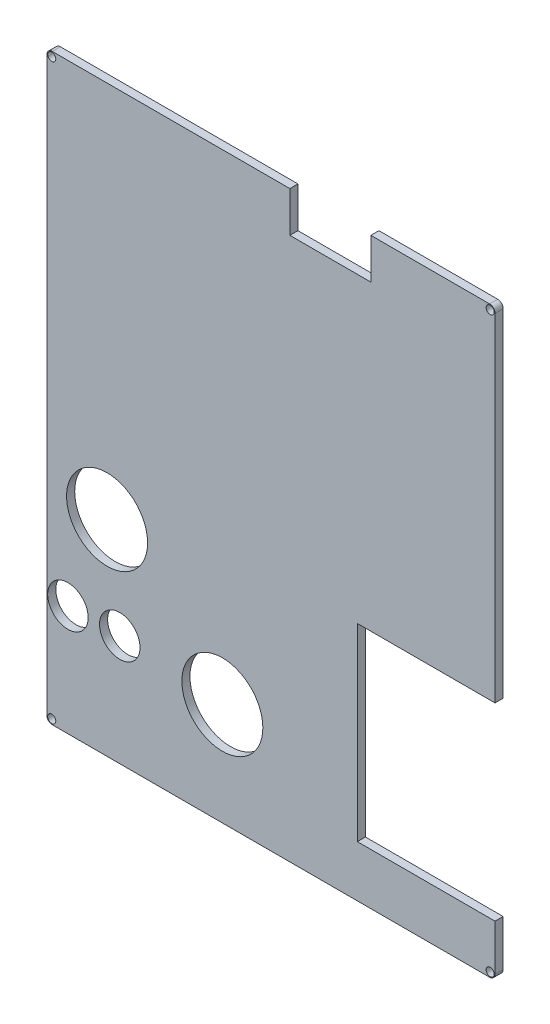
ISO-10303-21;
HEADER;
FILE_DESCRIPTION(('STEP AP214'),'2;1');
FILE_NAME('part.step','',(''),(''),'','','');
FILE_SCHEMA(('AUTOMOTIVE_DESIGN { 1 0 10303 214 1 1 1 1 }'));
ENDSEC;
DATA;
#1=APPLICATION_CONTEXT('core data for automotive mechanical design processes');
#2=APPLICATION_PROTOCOL_DEFINITION('international standard','automotive_design',2000,#1);
#3=PRODUCT_CONTEXT('',#1,'mechanical');
#4=PRODUCT('Part','Part','',(#3));
#5=PRODUCT_RELATED_PRODUCT_CATEGORY('part','',(#4));
#6=PRODUCT_DEFINITION_FORMATION('','',#4);
#7=PRODUCT_DEFINITION_CONTEXT('part definition',#1,'design');
#8=PRODUCT_DEFINITION('design','',#6,#7);
#9=PRODUCT_DEFINITION_SHAPE('','',#8);
#10=(LENGTH_UNIT() NAMED_UNIT(*) SI_UNIT(.MILLI.,.METRE.));
#11=(NAMED_UNIT(*) PLANE_ANGLE_UNIT() SI_UNIT($,.RADIAN.));
#12=(NAMED_UNIT(*) SI_UNIT($,.STERADIAN.) SOLID_ANGLE_UNIT());
#13=UNCERTAINTY_MEASURE_WITH_UNIT(LENGTH_MEASURE(1.E-05),#10,'distance_accuracy_value','');
#14=(GEOMETRIC_REPRESENTATION_CONTEXT(3) GLOBAL_UNCERTAINTY_ASSIGNED_CONTEXT((#13)) GLOBAL_UNIT_ASSIGNED_CONTEXT((#10,
#11,#12)) REPRESENTATION_CONTEXT('',''));
#15=CARTESIAN_POINT('',(0.,0.,0.));
#16=DIRECTION('',(0.,0.,1.));
#17=DIRECTION('',(1.,0.,0.));
#18=AXIS2_PLACEMENT_3D('',#15,#16,#17);
#19=CARTESIAN_POINT('',(-0.269341232726582,0.,0.));
#20=DIRECTION('',(1.,0.,0.));
#21=DIRECTION('',(0.,1.,0.));
#22=AXIS2_PLACEMENT_3D('',#19,#20,#21);
#23=PLANE('',#22);
#24=DIRECTION('',(0.,1.,0.));
#25=VECTOR('',#24,1.);
#26=CARTESIAN_POINT('',(-0.269341232726599,130.41095890411,0.));
#27=LINE('',#26,#25);
#28=CARTESIAN_POINT('',(-0.269341232726582,3.41095890410956,0.));
#29=VERTEX_POINT('',#28);
#30=CARTESIAN_POINT('',(-0.269341232726599,128.41095890411,0.));
#31=VERTEX_POINT('',#30);
#32=EDGE_CURVE('E166',#29,#31,#27,.T.);
#33=ORIENTED_EDGE('',*,*,#32,.T.);
#34=DIRECTION('',(0.,0.,1.));
#35=VECTOR('',#34,1.);
#36=CARTESIAN_POINT('',(-0.269341232726599,128.41095890411,0.));
#37=LINE('',#36,#35);
#38=CARTESIAN_POINT('',(-0.269341232726599,128.41095890411,3.));
#39=VERTEX_POINT('',#38);
#40=EDGE_CURVE('E340',#31,#39,#37,.T.);
#41=ORIENTED_EDGE('',*,*,#40,.T.);
#42=DIRECTION('',(0.,-1.,0.));
#43=VECTOR('',#42,1.);
#44=CARTESIAN_POINT('',(-0.269341232726599,130.41095890411,3.));
#45=LINE('',#44,#43);
#46=CARTESIAN_POINT('',(-0.269341232726583,3.41095890410956,3.));
#47=VERTEX_POINT('',#46);
#48=EDGE_CURVE('E203',#39,#47,#45,.T.);
#49=ORIENTED_EDGE('',*,*,#48,.T.);
#50=DIRECTION('',(0.,0.,1.));
#51=VECTOR('',#50,1.);
#52=CARTESIAN_POINT('',(-0.269341232726583,3.41095890410956,3.));
#53=LINE('',#52,#51);
#54=EDGE_CURVE('E183',#29,#47,#53,.T.);
#55=ORIENTED_EDGE('',*,*,#54,.F.);
#56=EDGE_LOOP('',(#33,#41,#49,#55));
#57=FACE_BOUND('',#56,.T.);
#58=ADVANCED_FACE('F39',(#57),#23,.T.);
#59=CARTESIAN_POINT('',(-166.269341232727,130.41095890411,3.));
#60=DIRECTION('',(0.,1.,0.));
#61=DIRECTION('',(-1.,0.,0.));
#62=AXIS2_PLACEMENT_3D('',#59,#60,#61);
#63=PLANE('',#62);
#64=DIRECTION('',(0.,0.,1.));
#65=VECTOR('',#64,1.);
#66=CARTESIAN_POINT('',(-76.2693412327266,130.41095890411,-853.));
#67=LINE('',#66,#65);
#68=CARTESIAN_POINT('',(-76.2693412327266,130.41095890411,-2.22044604925031E-13));
#69=VERTEX_POINT('',#68);
#70=CARTESIAN_POINT('',(-76.2693412327266,130.41095890411,3.));
#71=VERTEX_POINT('',#70);
#72=EDGE_CURVE('E217',#69,#71,#67,.T.);
#73=ORIENTED_EDGE('',*,*,#72,.F.);
#74=DIRECTION('',(1.,0.,0.));
#75=VECTOR('',#74,1.);
#76=CARTESIAN_POINT('',(-166.269341232727,130.41095890411,0.));
#77=LINE('',#76,#75);
#78=CARTESIAN_POINT('',(-164.269341232727,130.41095890411,0.));
#79=VERTEX_POINT('',#78);
#80=EDGE_CURVE('E279',#79,#69,#77,.T.);
#81=ORIENTED_EDGE('',*,*,#80,.F.);
#82=DIRECTION('',(0.,0.,-1.));
#83=VECTOR('',#82,1.);
#84=CARTESIAN_POINT('',(-164.269341232727,130.41095890411,3.));
#85=LINE('',#84,#83);
#86=CARTESIAN_POINT('',(-164.269341232727,130.41095890411,3.));
#87=VERTEX_POINT('',#86);
#88=EDGE_CURVE('E293',#79,#87,#85,.F.);
#89=ORIENTED_EDGE('',*,*,#88,.T.);
#90=DIRECTION('',(1.,0.,0.));
#91=VECTOR('',#90,1.);
#92=CARTESIAN_POINT('',(-166.269341232727,130.41095890411,3.));
#93=LINE('',#92,#91);
#94=EDGE_CURVE('E270',#87,#71,#93,.T.);
#95=ORIENTED_EDGE('',*,*,#94,.T.);
#96=EDGE_LOOP('',(#73,#81,#89,#95));
#97=FACE_BOUND('',#96,.T.);
#98=ADVANCED_FACE('F388',(#97),#63,.T.);
#99=CARTESIAN_POINT('',(-46.2693412327266,130.41095890411,3.));
#100=VERTEX_POINT('',#99);
#101=CARTESIAN_POINT('',(-2.2693412327266,130.41095890411,3.));
#102=VERTEX_POINT('',#101);
#103=EDGE_CURVE('E275',#100,#102,#93,.T.);
#104=ORIENTED_EDGE('',*,*,#103,.T.);
#105=DIRECTION('',(0.,0.,1.));
#106=VECTOR('',#105,1.);
#107=CARTESIAN_POINT('',(-2.2693412327266,130.41095890411,3.));
#108=LINE('',#107,#106);
#109=CARTESIAN_POINT('',(-2.2693412327266,130.41095890411,0.));
#110=VERTEX_POINT('',#109);
#111=EDGE_CURVE('E347',#102,#110,#108,.F.);
#112=ORIENTED_EDGE('',*,*,#111,.T.);
#113=CARTESIAN_POINT('',(-46.2693412327266,130.41095890411,-2.22044604925031E-13));
#114=VERTEX_POINT('',#113);
#115=EDGE_CURVE('E284',#114,#110,#77,.T.);
#116=ORIENTED_EDGE('',*,*,#115,.F.);
#117=DIRECTION('',(0.,0.,1.));
#118=VECTOR('',#117,1.);
#119=CARTESIAN_POINT('',(-46.2693412327266,130.41095890411,-853.));
#120=LINE('',#119,#118);
#121=EDGE_CURVE('E221',#114,#100,#120,.T.);
#122=ORIENTED_EDGE('',*,*,#121,.T.);
#123=EDGE_LOOP('',(#104,#112,#116,#122));
#124=FACE_BOUND('',#123,.T.);
#125=ADVANCED_FACE('F404',(#124),#63,.T.);
#126=CARTESIAN_POINT('',(-166.269341232727,130.41095890411,3.));
#127=DIRECTION('',(1.,0.,0.));
#128=DIRECTION('',(0.,0.,-1.));
#129=AXIS2_PLACEMENT_3D('',#126,#127,#128);
#130=PLANE('',#129);
#131=DIRECTION('',(0.,-1.,0.));
#132=VECTOR('',#131,1.);
#133=CARTESIAN_POINT('',(-166.269341232727,130.41095890411,0.));
#134=LINE('',#133,#132);
#135=CARTESIAN_POINT('',(-166.269341232727,128.41095890411,0.));
#136=VERTEX_POINT('',#135);
#137=CARTESIAN_POINT('',(-166.269341232727,-83.5890410958905,0.));
#138=VERTEX_POINT('',#137);
#139=EDGE_CURVE('E283',#136,#138,#134,.T.);
#140=ORIENTED_EDGE('',*,*,#139,.T.);
#141=DIRECTION('',(0.,0.,-1.));
#142=VECTOR('',#141,1.);
#143=CARTESIAN_POINT('',(-166.269341232727,-83.5890410958905,3.));
#144=LINE('',#143,#142);
#145=CARTESIAN_POINT('',(-166.269341232727,-83.5890410958905,3.));
#146=VERTEX_POINT('',#145);
#147=EDGE_CURVE('E48',#138,#146,#144,.F.);
#148=ORIENTED_EDGE('',*,*,#147,.T.);
#149=DIRECTION('',(0.,-1.,0.));
#150=VECTOR('',#149,1.);
#151=CARTESIAN_POINT('',(-166.269341232727,130.41095890411,3.));
#152=LINE('',#151,#150);
#153=CARTESIAN_POINT('',(-166.269341232727,128.41095890411,3.));
#154=VERTEX_POINT('',#153);
#155=EDGE_CURVE('E274',#154,#146,#152,.T.);
#156=ORIENTED_EDGE('',*,*,#155,.F.);
#157=DIRECTION('',(0.,0.,-1.));
#158=VECTOR('',#157,1.);
#159=CARTESIAN_POINT('',(-166.269341232727,128.41095890411,0.));
#160=LINE('',#159,#158);
#161=EDGE_CURVE('E278',#154,#136,#160,.T.);
#162=ORIENTED_EDGE('',*,*,#161,.T.);
#163=EDGE_LOOP('',(#140,#148,#156,#162));
#164=FACE_BOUND('',#163,.T.);
#165=ADVANCED_FACE('F380',(#164),#130,.F.);
#166=CARTESIAN_POINT('',(0.,0.,3.));
#167=DIRECTION('',(0.,0.,-1.));
#168=DIRECTION('',(-1.,0.,0.));
#169=AXIS2_PLACEMENT_3D('',#166,#167,#168);
#170=PLANE('',#169);
#171=CARTESIAN_POINT('',(-164.469341232727,-83.7890410958904,3.));
#172=DIRECTION('',(0.,0.,1.));
#173=DIRECTION('',(1.,0.,0.));
#174=AXIS2_PLACEMENT_3D('',#171,#172,#173);
#175=CIRCLE('',#174,1.5);
#176=CARTESIAN_POINT('',(-162.969341232727,-83.7890410958904,3.));
#177=VERTEX_POINT('',#176);
#178=EDGE_CURVE('E720',#177,#177,#175,.T.);
#179=ORIENTED_EDGE('',*,*,#178,.F.);
#180=EDGE_LOOP('',(#179));
#181=FACE_BOUND('',#180,.T.);
#182=CARTESIAN_POINT('',(-2.06934123272657,-83.7890410958905,3.));
#183=DIRECTION('',(0.,0.,1.));
#184=DIRECTION('',(1.,0.,0.));
#185=AXIS2_PLACEMENT_3D('',#182,#183,#184);
#186=CIRCLE('',#185,1.5);
#187=CARTESIAN_POINT('',(-0.569341232726571,-83.7890410958905,3.));
#188=VERTEX_POINT('',#187);
#189=EDGE_CURVE('E711',#188,#188,#186,.T.);
#190=ORIENTED_EDGE('',*,*,#189,.F.);
#191=EDGE_LOOP('',(#190));
#192=FACE_BOUND('',#191,.T.);
#193=CARTESIAN_POINT('',(-2.0693412327266,128.61095890411,3.));
#194=DIRECTION('',(0.,0.,1.));
#195=DIRECTION('',(1.,0.,0.));
#196=AXIS2_PLACEMENT_3D('',#193,#194,#195);
#197=CIRCLE('',#196,1.5);
#198=CARTESIAN_POINT('',(-0.569341232726598,128.61095890411,3.));
#199=VERTEX_POINT('',#198);
#200=EDGE_CURVE('E192',#199,#199,#197,.T.);
#201=ORIENTED_EDGE('',*,*,#200,.F.);
#202=EDGE_LOOP('',(#201));
#203=FACE_BOUND('',#202,.T.);
#204=CARTESIAN_POINT('',(-158.469341232727,-44.5890410958904,3.));
#205=DIRECTION('',(0.,0.,1.));
#206=DIRECTION('',(1.,0.,0.));
#207=AXIS2_PLACEMENT_3D('',#204,#205,#206);
#208=CIRCLE('',#207,7.50000000000001);
#209=CARTESIAN_POINT('',(-150.969341232727,-44.5890410958904,3.));
#210=VERTEX_POINT('',#209);
#211=EDGE_CURVE('E220',#210,#210,#208,.T.);
#212=ORIENTED_EDGE('',*,*,#211,.F.);
#213=EDGE_LOOP('',(#212));
#214=FACE_BOUND('',#213,.T.);
#215=CARTESIAN_POINT('',(-139.269341232727,-44.5890410958904,3.));
#216=DIRECTION('',(0.,0.,1.));
#217=DIRECTION('',(1.,0.,0.));
#218=AXIS2_PLACEMENT_3D('',#215,#216,#217);
#219=CIRCLE('',#218,7.50000000000001);
#220=CARTESIAN_POINT('',(-131.769341232727,-44.5890410958904,3.));
#221=VERTEX_POINT('',#220);
#222=EDGE_CURVE('E234',#221,#221,#219,.T.);
#223=ORIENTED_EDGE('',*,*,#222,.F.);
#224=EDGE_LOOP('',(#223));
#225=FACE_BOUND('',#224,.T.);
#226=CARTESIAN_POINT('',(-143.966076440975,-9.58904109589044,3.));
#227=DIRECTION('',(0.,0.,1.));
#228=DIRECTION('',(1.,0.,0.));
#229=AXIS2_PLACEMENT_3D('',#226,#227,#228);
#230=CIRCLE('',#229,15.);
#231=CARTESIAN_POINT('',(-128.966076440975,-9.58904109589044,3.));
#232=VERTEX_POINT('',#231);
#233=EDGE_CURVE('E239',#232,#232,#230,.T.);
#234=ORIENTED_EDGE('',*,*,#233,.F.);
#235=EDGE_LOOP('',(#234));
#236=FACE_BOUND('',#235,.T.);
#237=CARTESIAN_POINT('',(-101.269341232727,-47.5890410958904,3.));
#238=DIRECTION('',(0.,0.,1.));
#239=DIRECTION('',(1.,0.,0.));
#240=AXIS2_PLACEMENT_3D('',#237,#238,#239);
#241=CIRCLE('',#240,15.);
#242=CARTESIAN_POINT('',(-86.2693412327266,-47.5890410958904,3.));
#243=VERTEX_POINT('',#242);
#244=EDGE_CURVE('E244',#243,#243,#241,.T.);
#245=ORIENTED_EDGE('',*,*,#244,.F.);
#246=EDGE_LOOP('',(#245));
#247=FACE_BOUND('',#246,.T.);
#248=CARTESIAN_POINT('',(-164.469341232727,128.61095890411,3.));
#249=DIRECTION('',(0.,0.,1.));
#250=DIRECTION('',(1.,0.,0.));
#251=AXIS2_PLACEMENT_3D('',#248,#249,#250);
#252=CIRCLE('',#251,1.5);
#253=CARTESIAN_POINT('',(-162.969341232727,128.61095890411,3.));
#254=VERTEX_POINT('',#253);
#255=EDGE_CURVE('E263',#254,#254,#252,.T.);
#256=ORIENTED_EDGE('',*,*,#255,.F.);
#257=EDGE_LOOP('',(#256));
#258=FACE_BOUND('',#257,.T.);
#259=ORIENTED_EDGE('',*,*,#155,.T.);
#260=CARTESIAN_POINT('',(-164.269341232727,-83.5890410958905,3.));
#261=DIRECTION('',(0.,0.,-1.));
#262=DIRECTION('',(-1.,0.,0.));
#263=AXIS2_PLACEMENT_3D('',#260,#261,#262);
#264=CIRCLE('',#263,2.);
#265=CARTESIAN_POINT('',(-164.269341232727,-85.5890410958905,3.));
#266=VERTEX_POINT('',#265);
#267=EDGE_CURVE('E11',#146,#266,#264,.F.);
#268=ORIENTED_EDGE('',*,*,#267,.T.);
#269=DIRECTION('',(-1.,0.,0.));
#270=VECTOR('',#269,1.);
#271=CARTESIAN_POINT('',(-166.269341232727,-85.5890410958905,3.));
#272=LINE('',#271,#270);
#273=CARTESIAN_POINT('',(-2.26934123272662,-85.5890410958905,3.));
#274=VERTEX_POINT('',#273);
#275=EDGE_CURVE('E198',#274,#266,#272,.T.);
#276=ORIENTED_EDGE('',*,*,#275,.F.);
#277=CARTESIAN_POINT('',(-2.26934123272657,-83.5890410958905,3.));
#278=DIRECTION('',(0.,0.,-1.));
#279=DIRECTION('',(-1.,0.,0.));
#280=AXIS2_PLACEMENT_3D('',#277,#278,#279);
#281=CIRCLE('',#280,2.);
#282=CARTESIAN_POINT('',(-0.269341232726571,-83.5890410958904,3.));
#283=VERTEX_POINT('',#282);
#284=EDGE_CURVE('E332',#274,#283,#281,.F.);
#285=ORIENTED_EDGE('',*,*,#284,.T.);
#286=CARTESIAN_POINT('',(-0.269341232726573,-66.5890410958905,3.));
#287=VERTEX_POINT('',#286);
#288=EDGE_CURVE('E202',#287,#283,#45,.T.);
#289=ORIENTED_EDGE('',*,*,#288,.F.);
#290=DIRECTION('',(1.,0.,0.));
#291=VECTOR('',#290,1.);
#292=CARTESIAN_POINT('',(-51.2693412327266,-66.5890410958905,3.));
#293=LINE('',#292,#291);
#294=CARTESIAN_POINT('',(-51.2693412327266,-66.5890410958905,3.));
#295=VERTEX_POINT('',#294);
#296=EDGE_CURVE('E181',#295,#287,#293,.T.);
#297=ORIENTED_EDGE('',*,*,#296,.F.);
#298=DIRECTION('',(0.,-1.,0.));
#299=VECTOR('',#298,1.);
#300=CARTESIAN_POINT('',(-51.2693412327266,3.41095890410956,3.));
#301=LINE('',#300,#299);
#302=CARTESIAN_POINT('',(-51.2693412327266,3.41095890410956,3.));
#303=VERTEX_POINT('',#302);
#304=EDGE_CURVE('E255',#303,#295,#301,.T.);
#305=ORIENTED_EDGE('',*,*,#304,.F.);
#306=DIRECTION('',(1.,0.,0.));
#307=VECTOR('',#306,1.);
#308=CARTESIAN_POINT('',(-51.2693412327266,3.41095890410956,3.));
#309=LINE('',#308,#307);
#310=EDGE_CURVE('E251',#303,#47,#309,.T.);
#311=ORIENTED_EDGE('',*,*,#310,.T.);
#312=ORIENTED_EDGE('',*,*,#48,.F.);
#313=CARTESIAN_POINT('',(-2.2693412327266,128.41095890411,3.));
#314=DIRECTION('',(0.,0.,-1.));
#315=DIRECTION('',(-1.,0.,0.));
#316=AXIS2_PLACEMENT_3D('',#313,#314,#315);
#317=CIRCLE('',#316,2.);
#318=EDGE_CURVE('E344',#39,#102,#317,.F.);
#319=ORIENTED_EDGE('',*,*,#318,.T.);
#320=ORIENTED_EDGE('',*,*,#103,.F.);
#321=DIRECTION('',(0.,1.,0.));
#322=VECTOR('',#321,1.);
#323=CARTESIAN_POINT('',(-46.2693412327266,115.41095890411,3.));
#324=LINE('',#323,#322);
#325=CARTESIAN_POINT('',(-46.2693412327266,115.41095890411,3.));
#326=VERTEX_POINT('',#325);
#327=EDGE_CURVE('E213',#326,#100,#324,.T.);
#328=ORIENTED_EDGE('',*,*,#327,.F.);
#329=DIRECTION('',(1.,0.,0.));
#330=VECTOR('',#329,1.);
#331=CARTESIAN_POINT('',(-76.2693412327266,115.41095890411,3.));
#332=LINE('',#331,#330);
#333=CARTESIAN_POINT('',(-76.2693412327266,115.41095890411,3.));
#334=VERTEX_POINT('',#333);
#335=EDGE_CURVE('E209',#334,#326,#332,.T.);
#336=ORIENTED_EDGE('',*,*,#335,.F.);
#337=DIRECTION('',(0.,-1.,0.));
#338=VECTOR('',#337,1.);
#339=CARTESIAN_POINT('',(-76.2693412327266,115.41095890411,3.));
#340=LINE('',#339,#338);
#341=EDGE_CURVE('E165',#71,#334,#340,.T.);
#342=ORIENTED_EDGE('',*,*,#341,.F.);
#343=ORIENTED_EDGE('',*,*,#94,.F.);
#344=CARTESIAN_POINT('',(-164.269341232727,128.41095890411,3.));
#345=DIRECTION('',(0.,0.,-1.));
#346=DIRECTION('',(-1.,0.,0.));
#347=AXIS2_PLACEMENT_3D('',#344,#345,#346);
#348=CIRCLE('',#347,2.);
#349=EDGE_CURVE('E296',#87,#154,#348,.F.);
#350=ORIENTED_EDGE('',*,*,#349,.T.);
#351=EDGE_LOOP('',(#259,#268,#276,#285,#289,#297,#305,#311,#312,#319,#320,#328,#336,#342,#343,#350));
#352=FACE_BOUND('',#351,.T.);
#353=ADVANCED_FACE('F376',(#181,#192,#203,#214,#225,#236,#247,#258,#352),#170,.F.);
#354=CARTESIAN_POINT('',(0.,0.,0.));
#355=DIRECTION('',(0.,0.,-1.));
#356=DIRECTION('',(-1.,0.,0.));
#357=AXIS2_PLACEMENT_3D('',#354,#355,#356);
#358=PLANE('',#357);
#359=CARTESIAN_POINT('',(-164.469341232727,-83.7890410958904,0.));
#360=DIRECTION('',(0.,0.,1.));
#361=DIRECTION('',(1.,0.,0.));
#362=AXIS2_PLACEMENT_3D('',#359,#360,#361);
#363=CIRCLE('',#362,1.5);
#364=CARTESIAN_POINT('',(-162.969341232727,-83.7890410958904,0.));
#365=VERTEX_POINT('',#364);
#366=EDGE_CURVE('E717',#365,#365,#363,.T.);
#367=ORIENTED_EDGE('',*,*,#366,.T.);
#368=EDGE_LOOP('',(#367));
#369=FACE_BOUND('',#368,.T.);
#370=CARTESIAN_POINT('',(-2.06934123272657,-83.7890410958905,0.));
#371=DIRECTION('',(0.,0.,1.));
#372=DIRECTION('',(1.,0.,0.));
#373=AXIS2_PLACEMENT_3D('',#370,#371,#372);
#374=CIRCLE('',#373,1.5);
#375=CARTESIAN_POINT('',(-0.569341232726571,-83.7890410958905,0.));
#376=VERTEX_POINT('',#375);
#377=EDGE_CURVE('E708',#376,#376,#374,.T.);
#378=ORIENTED_EDGE('',*,*,#377,.T.);
#379=EDGE_LOOP('',(#378));
#380=FACE_BOUND('',#379,.T.);
#381=CARTESIAN_POINT('',(-2.0693412327266,128.61095890411,0.));
#382=DIRECTION('',(0.,0.,1.));
#383=DIRECTION('',(1.,0.,0.));
#384=AXIS2_PLACEMENT_3D('',#381,#382,#383);
#385=CIRCLE('',#384,1.5);
#386=CARTESIAN_POINT('',(-0.569341232726598,128.61095890411,0.));
#387=VERTEX_POINT('',#386);
#388=EDGE_CURVE('E184',#387,#387,#385,.T.);
#389=ORIENTED_EDGE('',*,*,#388,.T.);
#390=EDGE_LOOP('',(#389));
#391=FACE_BOUND('',#390,.T.);
#392=DIRECTION('',(1.,0.,0.));
#393=VECTOR('',#392,1.);
#394=CARTESIAN_POINT('',(-166.269341232727,-85.5890410958905,0.));
#395=LINE('',#394,#393);
#396=CARTESIAN_POINT('',(-164.269341232727,-85.5890410958905,0.));
#397=VERTEX_POINT('',#396);
#398=CARTESIAN_POINT('',(-2.26934123272662,-85.5890410958905,0.));
#399=VERTEX_POINT('',#398);
#400=EDGE_CURVE('E189',#397,#399,#395,.T.);
#401=ORIENTED_EDGE('',*,*,#400,.F.);
#402=CARTESIAN_POINT('',(-164.269341232727,-83.5890410958905,0.));
#403=DIRECTION('',(0.,0.,-1.));
#404=DIRECTION('',(-1.,0.,0.));
#405=AXIS2_PLACEMENT_3D('',#402,#403,#404);
#406=CIRCLE('',#405,2.);
#407=EDGE_CURVE('E62',#397,#138,#406,.T.);
#408=ORIENTED_EDGE('',*,*,#407,.T.);
#409=ORIENTED_EDGE('',*,*,#139,.F.);
#410=CARTESIAN_POINT('',(-164.269341232727,128.41095890411,0.));
#411=DIRECTION('',(0.,0.,-1.));
#412=DIRECTION('',(-1.,0.,0.));
#413=AXIS2_PLACEMENT_3D('',#410,#411,#412);
#414=CIRCLE('',#413,2.);
#415=EDGE_CURVE('E290',#136,#79,#414,.T.);
#416=ORIENTED_EDGE('',*,*,#415,.T.);
#417=ORIENTED_EDGE('',*,*,#80,.T.);
#418=DIRECTION('',(0.,1.,0.));
#419=VECTOR('',#418,1.);
#420=CARTESIAN_POINT('',(-76.2693412327266,0.,0.));
#421=LINE('',#420,#419);
#422=CARTESIAN_POINT('',(-76.2693412327266,115.41095890411,-2.22044604925031E-13));
#423=VERTEX_POINT('',#422);
#424=EDGE_CURVE('E325',#423,#69,#421,.T.);
#425=ORIENTED_EDGE('',*,*,#424,.F.);
#426=DIRECTION('',(-1.,0.,0.));
#427=VECTOR('',#426,1.);
#428=CARTESIAN_POINT('',(0.,115.41095890411,0.));
#429=LINE('',#428,#427);
#430=CARTESIAN_POINT('',(-46.2693412327266,115.41095890411,0.));
#431=VERTEX_POINT('',#430);
#432=EDGE_CURVE('E177',#431,#423,#429,.T.);
#433=ORIENTED_EDGE('',*,*,#432,.F.);
#434=DIRECTION('',(0.,-1.,0.));
#435=VECTOR('',#434,1.);
#436=CARTESIAN_POINT('',(-46.2693412327266,0.,0.));
#437=LINE('',#436,#435);
#438=EDGE_CURVE('E321',#114,#431,#437,.T.);
#439=ORIENTED_EDGE('',*,*,#438,.F.);
#440=ORIENTED_EDGE('',*,*,#115,.T.);
#441=CARTESIAN_POINT('',(-2.2693412327266,128.41095890411,0.));
#442=DIRECTION('',(0.,0.,-1.));
#443=DIRECTION('',(-1.,0.,0.));
#444=AXIS2_PLACEMENT_3D('',#441,#442,#443);
#445=CIRCLE('',#444,2.);
#446=EDGE_CURVE('E350',#110,#31,#445,.T.);
#447=ORIENTED_EDGE('',*,*,#446,.T.);
#448=ORIENTED_EDGE('',*,*,#32,.F.);
#449=DIRECTION('',(-1.,0.,0.));
#450=VECTOR('',#449,1.);
#451=CARTESIAN_POINT('',(0.,3.41095890410956,0.));
#452=LINE('',#451,#450);
#453=CARTESIAN_POINT('',(-51.2693412327266,3.41095890410956,0.));
#454=VERTEX_POINT('',#453);
#455=EDGE_CURVE('E299',#29,#454,#452,.T.);
#456=ORIENTED_EDGE('',*,*,#455,.T.);
#457=DIRECTION('',(0.,1.,0.));
#458=VECTOR('',#457,1.);
#459=CARTESIAN_POINT('',(-51.2693412327266,0.,0.));
#460=LINE('',#459,#458);
#461=CARTESIAN_POINT('',(-51.2693412327266,-66.5890410958905,0.));
#462=VERTEX_POINT('',#461);
#463=EDGE_CURVE('E173',#462,#454,#460,.T.);
#464=ORIENTED_EDGE('',*,*,#463,.F.);
#465=DIRECTION('',(-1.,0.,0.));
#466=VECTOR('',#465,1.);
#467=CARTESIAN_POINT('',(0.,-66.5890410958905,0.));
#468=LINE('',#467,#466);
#469=CARTESIAN_POINT('',(-0.269341232726573,-66.5890410958905,0.));
#470=VERTEX_POINT('',#469);
#471=EDGE_CURVE('E169',#470,#462,#468,.T.);
#472=ORIENTED_EDGE('',*,*,#471,.F.);
#473=CARTESIAN_POINT('',(-0.269341232726571,-83.5890410958904,0.));
#474=VERTEX_POINT('',#473);
#475=EDGE_CURVE('E153',#474,#470,#27,.T.);
#476=ORIENTED_EDGE('',*,*,#475,.F.);
#477=CARTESIAN_POINT('',(-2.26934123272657,-83.5890410958905,0.));
#478=DIRECTION('',(0.,0.,-1.));
#479=DIRECTION('',(-1.,0.,0.));
#480=AXIS2_PLACEMENT_3D('',#477,#478,#479);
#481=CIRCLE('',#480,2.);
#482=EDGE_CURVE('E337',#474,#399,#481,.T.);
#483=ORIENTED_EDGE('',*,*,#482,.T.);
#484=EDGE_LOOP('',(#401,#408,#409,#416,#417,#425,#433,#439,#440,#447,#448,#456,#464,#472,#476,#483));
#485=FACE_BOUND('',#484,.T.);
#486=CARTESIAN_POINT('',(-158.469341232727,-44.5890410958904,0.));
#487=DIRECTION('',(0.,0.,-1.));
#488=DIRECTION('',(-1.,0.,0.));
#489=AXIS2_PLACEMENT_3D('',#486,#487,#488);
#490=CIRCLE('',#489,7.50000000000001);
#491=CARTESIAN_POINT('',(-165.969341232727,-44.5890410958904,0.));
#492=VERTEX_POINT('',#491);
#493=EDGE_CURVE('E233',#492,#492,#490,.T.);
#494=ORIENTED_EDGE('',*,*,#493,.F.);
#495=EDGE_LOOP('',(#494));
#496=FACE_BOUND('',#495,.T.);
#497=CARTESIAN_POINT('',(-139.269341232727,-44.5890410958904,0.));
#498=DIRECTION('',(0.,0.,-1.));
#499=DIRECTION('',(-1.,0.,0.));
#500=AXIS2_PLACEMENT_3D('',#497,#498,#499);
#501=CIRCLE('',#500,7.50000000000001);
#502=CARTESIAN_POINT('',(-146.769341232727,-44.5890410958904,0.));
#503=VERTEX_POINT('',#502);
#504=EDGE_CURVE('E238',#503,#503,#501,.T.);
#505=ORIENTED_EDGE('',*,*,#504,.F.);
#506=EDGE_LOOP('',(#505));
#507=FACE_BOUND('',#506,.T.);
#508=CARTESIAN_POINT('',(-143.966076440975,-9.58904109589044,0.));
#509=DIRECTION('',(0.,0.,-1.));
#510=DIRECTION('',(-1.,0.,0.));
#511=AXIS2_PLACEMENT_3D('',#508,#509,#510);
#512=CIRCLE('',#511,15.);
#513=CARTESIAN_POINT('',(-158.966076440975,-9.58904109589044,0.));
#514=VERTEX_POINT('',#513);
#515=EDGE_CURVE('E243',#514,#514,#512,.T.);
#516=ORIENTED_EDGE('',*,*,#515,.F.);
#517=EDGE_LOOP('',(#516));
#518=FACE_BOUND('',#517,.T.);
#519=CARTESIAN_POINT('',(-101.269341232727,-47.5890410958904,0.));
#520=DIRECTION('',(0.,0.,-1.));
#521=DIRECTION('',(-1.,0.,0.));
#522=AXIS2_PLACEMENT_3D('',#519,#520,#521);
#523=CIRCLE('',#522,15.);
#524=CARTESIAN_POINT('',(-116.269341232727,-47.5890410958904,0.));
#525=VERTEX_POINT('',#524);
#526=EDGE_CURVE('E248',#525,#525,#523,.T.);
#527=ORIENTED_EDGE('',*,*,#526,.F.);
#528=EDGE_LOOP('',(#527));
#529=FACE_BOUND('',#528,.T.);
#530=CARTESIAN_POINT('',(-164.469341232727,128.61095890411,0.));
#531=DIRECTION('',(0.,0.,-1.));
#532=DIRECTION('',(-1.,0.,0.));
#533=AXIS2_PLACEMENT_3D('',#530,#531,#532);
#534=CIRCLE('',#533,1.5);
#535=CARTESIAN_POINT('',(-165.969341232727,128.61095890411,0.));
#536=VERTEX_POINT('',#535);
#537=EDGE_CURVE('E269',#536,#536,#534,.T.);
#538=ORIENTED_EDGE('',*,*,#537,.F.);
#539=EDGE_LOOP('',(#538));
#540=FACE_BOUND('',#539,.T.);
#541=ADVANCED_FACE('F170',(#369,#380,#391,#485,#496,#507,#518,#529,#540),#358,.T.);
#542=CARTESIAN_POINT('',(-164.269341232727,128.41095890411,3.));
#543=DIRECTION('',(0.,0.,1.));
#544=DIRECTION('',(1.,0.,0.));
#545=AXIS2_PLACEMENT_3D('',#542,#543,#544);
#546=CYLINDRICAL_SURFACE('',#545,2.);
#547=ORIENTED_EDGE('',*,*,#349,.F.);
#548=ORIENTED_EDGE('',*,*,#88,.F.);
#549=ORIENTED_EDGE('',*,*,#415,.F.);
#550=ORIENTED_EDGE('',*,*,#161,.F.);
#551=EDGE_LOOP('',(#547,#548,#549,#550));
#552=FACE_BOUND('',#551,.T.);
#553=ADVANCED_FACE('F382',(#552),#546,.T.);
#554=CARTESIAN_POINT('',(-164.469341232727,128.61095890411,-1.));
#555=DIRECTION('',(0.,0.,1.));
#556=DIRECTION('',(1.,0.,0.));
#557=AXIS2_PLACEMENT_3D('',#554,#555,#556);
#558=CYLINDRICAL_SURFACE('',#557,1.5);
#559=ORIENTED_EDGE('',*,*,#537,.T.);
#560=EDGE_LOOP('',(#559));
#561=FACE_BOUND('',#560,.T.);
#562=ORIENTED_EDGE('',*,*,#255,.T.);
#563=EDGE_LOOP('',(#562));
#564=FACE_BOUND('',#563,.T.);
#565=ADVANCED_FACE('F428',(#561,#564),#558,.F.);
#566=CARTESIAN_POINT('',(-51.2693412327266,-66.5890410958905,-1.));
#567=DIRECTION('',(0.,-1.,0.));
#568=DIRECTION('',(0.,0.,-1.));
#569=AXIS2_PLACEMENT_3D('',#566,#567,#568);
#570=PLANE('',#569);
#571=ORIENTED_EDGE('',*,*,#471,.T.);
#572=DIRECTION('',(0.,0.,1.));
#573=VECTOR('',#572,1.);
#574=CARTESIAN_POINT('',(-51.2693412327266,-66.5890410958905,-1.));
#575=LINE('',#574,#573);
#576=EDGE_CURVE('E260',#462,#295,#575,.T.);
#577=ORIENTED_EDGE('',*,*,#576,.T.);
#578=ORIENTED_EDGE('',*,*,#296,.T.);
#579=DIRECTION('',(0.,0.,-1.));
#580=VECTOR('',#579,1.);
#581=CARTESIAN_POINT('',(-0.269341232726573,-66.5890410958905,3.));
#582=LINE('',#581,#580);
#583=EDGE_CURVE('E158',#287,#470,#582,.T.);
#584=ORIENTED_EDGE('',*,*,#583,.T.);
#585=EDGE_LOOP('',(#571,#577,#578,#584));
#586=FACE_BOUND('',#585,.T.);
#587=ADVANCED_FACE('F179',(#586),#570,.F.);
#588=CARTESIAN_POINT('',(-51.2693412327266,3.41095890410956,-1.));
#589=DIRECTION('',(-1.,0.,0.));
#590=DIRECTION('',(0.,-1.,0.));
#591=AXIS2_PLACEMENT_3D('',#588,#589,#590);
#592=PLANE('',#591);
#593=ORIENTED_EDGE('',*,*,#463,.T.);
#594=DIRECTION('',(0.,0.,1.));
#595=VECTOR('',#594,1.);
#596=CARTESIAN_POINT('',(-51.2693412327266,3.41095890410956,-1.));
#597=LINE('',#596,#595);
#598=EDGE_CURVE('E259',#454,#303,#597,.T.);
#599=ORIENTED_EDGE('',*,*,#598,.T.);
#600=ORIENTED_EDGE('',*,*,#304,.T.);
#601=ORIENTED_EDGE('',*,*,#576,.F.);
#602=EDGE_LOOP('',(#593,#599,#600,#601));
#603=FACE_BOUND('',#602,.T.);
#604=ADVANCED_FACE('F419',(#603),#592,.F.);
#605=CARTESIAN_POINT('',(-51.2693412327266,3.41095890410956,-1.));
#606=DIRECTION('',(0.,-1.,0.));
#607=DIRECTION('',(0.,0.,-1.));
#608=AXIS2_PLACEMENT_3D('',#605,#606,#607);
#609=PLANE('',#608);
#610=ORIENTED_EDGE('',*,*,#455,.F.);
#611=ORIENTED_EDGE('',*,*,#54,.T.);
#612=ORIENTED_EDGE('',*,*,#310,.F.);
#613=ORIENTED_EDGE('',*,*,#598,.F.);
#614=EDGE_LOOP('',(#610,#611,#612,#613));
#615=FACE_BOUND('',#614,.T.);
#616=ADVANCED_FACE('F415',(#615),#609,.T.);
#617=CARTESIAN_POINT('',(-101.269341232727,-47.5890410958904,-853.));
#618=DIRECTION('',(0.,0.,1.));
#619=DIRECTION('',(1.,0.,0.));
#620=AXIS2_PLACEMENT_3D('',#617,#618,#619);
#621=CYLINDRICAL_SURFACE('',#620,15.);
#622=ORIENTED_EDGE('',*,*,#526,.T.);
#623=EDGE_LOOP('',(#622));
#624=FACE_BOUND('',#623,.T.);
#625=ORIENTED_EDGE('',*,*,#244,.T.);
#626=EDGE_LOOP('',(#625));
#627=FACE_BOUND('',#626,.T.);
#628=ADVANCED_FACE('F426',(#624,#627),#621,.F.);
#629=CARTESIAN_POINT('',(-143.966076440975,-9.58904109589044,-853.));
#630=DIRECTION('',(0.,0.,1.));
#631=DIRECTION('',(1.,0.,0.));
#632=AXIS2_PLACEMENT_3D('',#629,#630,#631);
#633=CYLINDRICAL_SURFACE('',#632,15.);
#634=ORIENTED_EDGE('',*,*,#515,.T.);
#635=EDGE_LOOP('',(#634));
#636=FACE_BOUND('',#635,.T.);
#637=ORIENTED_EDGE('',*,*,#233,.T.);
#638=EDGE_LOOP('',(#637));
#639=FACE_BOUND('',#638,.T.);
#640=ADVANCED_FACE('F460',(#636,#639),#633,.F.);
#641=CARTESIAN_POINT('',(-139.269341232727,-44.5890410958904,-853.));
#642=DIRECTION('',(0.,0.,1.));
#643=DIRECTION('',(1.,0.,0.));
#644=AXIS2_PLACEMENT_3D('',#641,#642,#643);
#645=CYLINDRICAL_SURFACE('',#644,7.50000000000001);
#646=ORIENTED_EDGE('',*,*,#504,.T.);
#647=EDGE_LOOP('',(#646));
#648=FACE_BOUND('',#647,.T.);
#649=ORIENTED_EDGE('',*,*,#222,.T.);
#650=EDGE_LOOP('',(#649));
#651=FACE_BOUND('',#650,.T.);
#652=ADVANCED_FACE('F456',(#648,#651),#645,.F.);
#653=CARTESIAN_POINT('',(-158.469341232727,-44.5890410958904,-853.));
#654=DIRECTION('',(0.,0.,1.));
#655=DIRECTION('',(1.,0.,0.));
#656=AXIS2_PLACEMENT_3D('',#653,#654,#655);
#657=CYLINDRICAL_SURFACE('',#656,7.50000000000001);
#658=ORIENTED_EDGE('',*,*,#493,.T.);
#659=EDGE_LOOP('',(#658));
#660=FACE_BOUND('',#659,.T.);
#661=ORIENTED_EDGE('',*,*,#211,.T.);
#662=EDGE_LOOP('',(#661));
#663=FACE_BOUND('',#662,.T.);
#664=ADVANCED_FACE('F453',(#660,#663),#657,.F.);
#665=CARTESIAN_POINT('',(-76.2693412327266,115.41095890411,-853.));
#666=DIRECTION('',(-1.,0.,0.));
#667=DIRECTION('',(0.,0.,1.));
#668=AXIS2_PLACEMENT_3D('',#665,#666,#667);
#669=PLANE('',#668);
#670=ORIENTED_EDGE('',*,*,#424,.T.);
#671=ORIENTED_EDGE('',*,*,#72,.T.);
#672=ORIENTED_EDGE('',*,*,#341,.T.);
#673=DIRECTION('',(0.,0.,1.));
#674=VECTOR('',#673,1.);
#675=CARTESIAN_POINT('',(-76.2693412327266,115.41095890411,-853.));
#676=LINE('',#675,#674);
#677=EDGE_CURVE('E216',#423,#334,#676,.T.);
#678=ORIENTED_EDGE('',*,*,#677,.F.);
#679=EDGE_LOOP('',(#670,#671,#672,#678));
#680=FACE_BOUND('',#679,.T.);
#681=ADVANCED_FACE('F391',(#680),#669,.F.);
#682=CARTESIAN_POINT('',(-46.2693412327266,115.41095890411,-853.));
#683=DIRECTION('',(1.,0.,0.));
#684=DIRECTION('',(0.,0.,-1.));
#685=AXIS2_PLACEMENT_3D('',#682,#683,#684);
#686=PLANE('',#685);
#687=ORIENTED_EDGE('',*,*,#438,.T.);
#688=DIRECTION('',(0.,0.,1.));
#689=VECTOR('',#688,1.);
#690=CARTESIAN_POINT('',(-46.2693412327266,115.41095890411,-853.));
#691=LINE('',#690,#689);
#692=EDGE_CURVE('E225',#431,#326,#691,.T.);
#693=ORIENTED_EDGE('',*,*,#692,.T.);
#694=ORIENTED_EDGE('',*,*,#327,.T.);
#695=ORIENTED_EDGE('',*,*,#121,.F.);
#696=EDGE_LOOP('',(#687,#693,#694,#695));
#697=FACE_BOUND('',#696,.T.);
#698=ADVANCED_FACE('F445',(#697),#686,.F.);
#699=CARTESIAN_POINT('',(-76.2693412327266,115.41095890411,-853.));
#700=DIRECTION('',(0.,-1.,0.));
#701=DIRECTION('',(0.,0.,-1.));
#702=AXIS2_PLACEMENT_3D('',#699,#700,#701);
#703=PLANE('',#702);
#704=ORIENTED_EDGE('',*,*,#432,.T.);
#705=ORIENTED_EDGE('',*,*,#677,.T.);
#706=ORIENTED_EDGE('',*,*,#335,.T.);
#707=ORIENTED_EDGE('',*,*,#692,.F.);
#708=EDGE_LOOP('',(#704,#705,#706,#707));
#709=FACE_BOUND('',#708,.T.);
#710=ADVANCED_FACE('F397',(#709),#703,.F.);
#711=ORIENTED_EDGE('',*,*,#288,.T.);
#712=DIRECTION('',(0.,0.,1.));
#713=VECTOR('',#712,1.);
#714=CARTESIAN_POINT('',(-0.269341232726571,-83.5890410958905,0.));
#715=LINE('',#714,#713);
#716=EDGE_CURVE('E161',#283,#474,#715,.F.);
#717=ORIENTED_EDGE('',*,*,#716,.T.);
#718=ORIENTED_EDGE('',*,*,#475,.T.);
#719=ORIENTED_EDGE('',*,*,#583,.F.);
#720=EDGE_LOOP('',(#711,#717,#718,#719));
#721=FACE_BOUND('',#720,.T.);
#722=ADVANCED_FACE('F156',(#721),#23,.T.);
#723=CARTESIAN_POINT('',(0.,-85.5890410958905,0.));
#724=DIRECTION('',(0.,-1.,0.));
#725=DIRECTION('',(0.,0.,-1.));
#726=AXIS2_PLACEMENT_3D('',#723,#724,#725);
#727=PLANE('',#726);
#728=ORIENTED_EDGE('',*,*,#275,.T.);
#729=DIRECTION('',(0.,0.,-1.));
#730=VECTOR('',#729,1.);
#731=CARTESIAN_POINT('',(-164.269341232727,-85.5890410958905,0.));
#732=LINE('',#731,#730);
#733=EDGE_CURVE('E353',#266,#397,#732,.T.);
#734=ORIENTED_EDGE('',*,*,#733,.T.);
#735=ORIENTED_EDGE('',*,*,#400,.T.);
#736=DIRECTION('',(0.,0.,1.));
#737=VECTOR('',#736,1.);
#738=CARTESIAN_POINT('',(-2.26934123272657,-85.5890410958905,0.));
#739=LINE('',#738,#737);
#740=EDGE_CURVE('E328',#399,#274,#739,.T.);
#741=ORIENTED_EDGE('',*,*,#740,.T.);
#742=EDGE_LOOP('',(#728,#734,#735,#741));
#743=FACE_BOUND('',#742,.T.);
#744=ADVANCED_FACE('F371',(#743),#727,.T.);
#745=CARTESIAN_POINT('',(-2.0693412327266,128.61095890411,0.));
#746=DIRECTION('',(0.,0.,1.));
#747=DIRECTION('',(1.,0.,0.));
#748=AXIS2_PLACEMENT_3D('',#745,#746,#747);
#749=CYLINDRICAL_SURFACE('',#748,1.5);
#750=ORIENTED_EDGE('',*,*,#388,.F.);
#751=EDGE_LOOP('',(#750));
#752=FACE_BOUND('',#751,.T.);
#753=ORIENTED_EDGE('',*,*,#200,.T.);
#754=EDGE_LOOP('',(#753));
#755=FACE_BOUND('',#754,.T.);
#756=ADVANCED_FACE('F444',(#752,#755),#749,.F.);
#757=CARTESIAN_POINT('',(-2.06934123272657,-83.7890410958905,0.));
#758=DIRECTION('',(0.,0.,1.));
#759=DIRECTION('',(1.,0.,0.));
#760=AXIS2_PLACEMENT_3D('',#757,#758,#759);
#761=CYLINDRICAL_SURFACE('',#760,1.5);
#762=ORIENTED_EDGE('',*,*,#377,.F.);
#763=EDGE_LOOP('',(#762));
#764=FACE_BOUND('',#763,.T.);
#765=ORIENTED_EDGE('',*,*,#189,.T.);
#766=EDGE_LOOP('',(#765));
#767=FACE_BOUND('',#766,.T.);
#768=ADVANCED_FACE('F566',(#764,#767),#761,.F.);
#769=CARTESIAN_POINT('',(-164.469341232727,-83.7890410958904,0.));
#770=DIRECTION('',(0.,0.,1.));
#771=DIRECTION('',(1.,0.,0.));
#772=AXIS2_PLACEMENT_3D('',#769,#770,#771);
#773=CYLINDRICAL_SURFACE('',#772,1.5);
#774=ORIENTED_EDGE('',*,*,#366,.F.);
#775=EDGE_LOOP('',(#774));
#776=FACE_BOUND('',#775,.T.);
#777=ORIENTED_EDGE('',*,*,#178,.T.);
#778=EDGE_LOOP('',(#777));
#779=FACE_BOUND('',#778,.T.);
#780=ADVANCED_FACE('F493',(#776,#779),#773,.F.);
#781=CARTESIAN_POINT('',(-2.26934123272657,-83.5890410958905,0.));
#782=DIRECTION('',(0.,0.,1.));
#783=DIRECTION('',(1.,0.,0.));
#784=AXIS2_PLACEMENT_3D('',#781,#782,#783);
#785=CYLINDRICAL_SURFACE('',#784,2.);
#786=ORIENTED_EDGE('',*,*,#482,.F.);
#787=ORIENTED_EDGE('',*,*,#716,.F.);
#788=ORIENTED_EDGE('',*,*,#284,.F.);
#789=ORIENTED_EDGE('',*,*,#740,.F.);
#790=EDGE_LOOP('',(#786,#787,#788,#789));
#791=FACE_BOUND('',#790,.T.);
#792=ADVANCED_FACE('F368',(#791),#785,.T.);
#793=CARTESIAN_POINT('',(-2.2693412327266,128.41095890411,0.));
#794=DIRECTION('',(0.,0.,1.));
#795=DIRECTION('',(1.,0.,0.));
#796=AXIS2_PLACEMENT_3D('',#793,#794,#795);
#797=CYLINDRICAL_SURFACE('',#796,2.);
#798=ORIENTED_EDGE('',*,*,#446,.F.);
#799=ORIENTED_EDGE('',*,*,#111,.F.);
#800=ORIENTED_EDGE('',*,*,#318,.F.);
#801=ORIENTED_EDGE('',*,*,#40,.F.);
#802=EDGE_LOOP('',(#798,#799,#800,#801));
#803=FACE_BOUND('',#802,.T.);
#804=ADVANCED_FACE('F407',(#803),#797,.T.);
#805=CARTESIAN_POINT('',(-164.269341232727,-83.5890410958905,0.));
#806=DIRECTION('',(0.,0.,1.));
#807=DIRECTION('',(1.,0.,0.));
#808=AXIS2_PLACEMENT_3D('',#805,#806,#807);
#809=CYLINDRICAL_SURFACE('',#808,2.);
#810=ORIENTED_EDGE('',*,*,#267,.F.);
#811=ORIENTED_EDGE('',*,*,#147,.F.);
#812=ORIENTED_EDGE('',*,*,#407,.F.);
#813=ORIENTED_EDGE('',*,*,#733,.F.);
#814=EDGE_LOOP('',(#810,#811,#812,#813));
#815=FACE_BOUND('',#814,.T.);
#816=ADVANCED_FACE('F41',(#815),#809,.T.);
#817=CLOSED_SHELL('',(#58,#98,#125,#165,#353,#541,#553,#565,#587,#604,#616,#628,#640,#652,#664,
#681,#698,#710,#722,#744,#756,#768,#780,#792,#804,#816));
#818=MANIFOLD_SOLID_BREP('B2',#817);
#819=ADVANCED_BREP_SHAPE_REPRESENTATION('',(#18,#818),#14);
#820=SHAPE_DEFINITION_REPRESENTATION(#9,#819);
ENDSEC;
END-ISO-10303-21;
